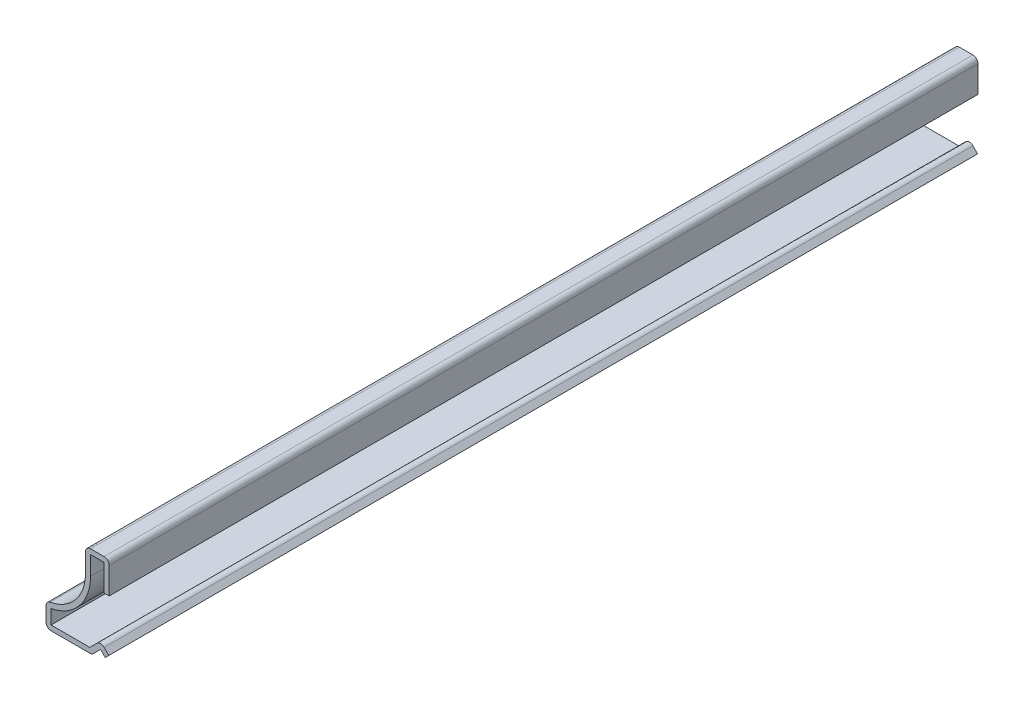
ISO-10303-21;
HEADER;
FILE_DESCRIPTION(('STEP AP214'),'2;1');
FILE_NAME('part.step','',(''),(''),'','','');
FILE_SCHEMA(('AUTOMOTIVE_DESIGN { 1 0 10303 214 1 1 1 1 }'));
ENDSEC;
DATA;
#1=APPLICATION_CONTEXT('core data for automotive mechanical design processes');
#2=APPLICATION_PROTOCOL_DEFINITION('international standard','automotive_design',2000,#1);
#3=PRODUCT_CONTEXT('',#1,'mechanical');
#4=PRODUCT('Part','Part','',(#3));
#5=PRODUCT_RELATED_PRODUCT_CATEGORY('part','',(#4));
#6=PRODUCT_DEFINITION_FORMATION('','',#4);
#7=PRODUCT_DEFINITION_CONTEXT('part definition',#1,'design');
#8=PRODUCT_DEFINITION('design','',#6,#7);
#9=PRODUCT_DEFINITION_SHAPE('','',#8);
#10=(LENGTH_UNIT() NAMED_UNIT(*) SI_UNIT(.MILLI.,.METRE.));
#11=(NAMED_UNIT(*) PLANE_ANGLE_UNIT() SI_UNIT($,.RADIAN.));
#12=(NAMED_UNIT(*) SI_UNIT($,.STERADIAN.) SOLID_ANGLE_UNIT());
#13=UNCERTAINTY_MEASURE_WITH_UNIT(LENGTH_MEASURE(1.E-05),#10,'distance_accuracy_value','');
#14=(GEOMETRIC_REPRESENTATION_CONTEXT(3) GLOBAL_UNCERTAINTY_ASSIGNED_CONTEXT((#13)) GLOBAL_UNIT_ASSIGNED_CONTEXT((#10,
#11,#12)) REPRESENTATION_CONTEXT('',''));
#15=CARTESIAN_POINT('',(0.,0.,0.));
#16=DIRECTION('',(0.,0.,1.));
#17=DIRECTION('',(1.,0.,0.));
#18=AXIS2_PLACEMENT_3D('',#15,#16,#17);
#19=CARTESIAN_POINT('',(0.,11.90625,-174.625));
#20=DIRECTION('',(0.,-1.,0.));
#21=DIRECTION('',(0.,0.,-1.));
#22=AXIS2_PLACEMENT_3D('',#19,#20,#21);
#23=PLANE('',#22);
#24=DIRECTION('',(1.,0.,0.));
#25=VECTOR('',#24,1.);
#26=CARTESIAN_POINT('',(0.,11.90625,0.));
#27=LINE('',#26,#25);
#28=CARTESIAN_POINT('',(-1.016,11.90625,0.));
#29=VERTEX_POINT('',#28);
#30=CARTESIAN_POINT('',(0.,11.90625,0.));
#31=VERTEX_POINT('',#30);
#32=EDGE_CURVE('E266',#29,#31,#27,.T.);
#33=ORIENTED_EDGE('',*,*,#32,.F.);
#34=DIRECTION('',(0.,0.,1.));
#35=VECTOR('',#34,1.);
#36=CARTESIAN_POINT('',(-1.016,11.90625,-174.625));
#37=LINE('',#36,#35);
#38=CARTESIAN_POINT('',(-1.016,11.90625,-174.625));
#39=VERTEX_POINT('',#38);
#40=EDGE_CURVE('E218',#39,#29,#37,.T.);
#41=ORIENTED_EDGE('',*,*,#40,.F.);
#42=DIRECTION('',(1.,0.,0.));
#43=VECTOR('',#42,1.);
#44=CARTESIAN_POINT('',(0.,11.90625,-174.625));
#45=LINE('',#44,#43);
#46=CARTESIAN_POINT('',(0.,11.90625,-174.625));
#47=VERTEX_POINT('',#46);
#48=EDGE_CURVE('E214',#39,#47,#45,.T.);
#49=ORIENTED_EDGE('',*,*,#48,.T.);
#50=DIRECTION('',(0.,0.,1.));
#51=VECTOR('',#50,1.);
#52=CARTESIAN_POINT('',(0.,11.90625,-174.625));
#53=LINE('',#52,#51);
#54=EDGE_CURVE('E197',#47,#31,#53,.T.);
#55=ORIENTED_EDGE('',*,*,#54,.T.);
#56=EDGE_LOOP('',(#33,#41,#49,#55));
#57=FACE_BOUND('',#56,.T.);
#58=ADVANCED_FACE('F35',(#57),#23,.T.);
#59=CARTESIAN_POINT('',(-1.016,11.90625,-174.625));
#60=DIRECTION('',(-1.,0.,0.));
#61=DIRECTION('',(0.,0.,1.));
#62=AXIS2_PLACEMENT_3D('',#59,#60,#61);
#63=PLANE('',#62);
#64=DIRECTION('',(0.,-1.,0.));
#65=VECTOR('',#64,1.);
#66=CARTESIAN_POINT('',(-1.016,11.90625,0.));
#67=LINE('',#66,#65);
#68=CARTESIAN_POINT('',(-1.016,17.24025,0.));
#69=VERTEX_POINT('',#68);
#70=EDGE_CURVE('E219',#69,#29,#67,.T.);
#71=ORIENTED_EDGE('',*,*,#70,.F.);
#72=DIRECTION('',(0.,0.,1.));
#73=VECTOR('',#72,1.);
#74=CARTESIAN_POINT('',(-1.016,17.24025,-174.625));
#75=LINE('',#74,#73);
#76=CARTESIAN_POINT('',(-1.016,17.24025,-174.625));
#77=VERTEX_POINT('',#76);
#78=EDGE_CURVE('E312',#77,#69,#75,.T.);
#79=ORIENTED_EDGE('',*,*,#78,.F.);
#80=DIRECTION('',(0.,-1.,0.));
#81=VECTOR('',#80,1.);
#82=CARTESIAN_POINT('',(-1.016,11.90625,-174.625));
#83=LINE('',#82,#81);
#84=EDGE_CURVE('E208',#77,#39,#83,.T.);
#85=ORIENTED_EDGE('',*,*,#84,.T.);
#86=ORIENTED_EDGE('',*,*,#40,.T.);
#87=EDGE_LOOP('',(#71,#79,#85,#86));
#88=FACE_BOUND('',#87,.T.);
#89=ADVANCED_FACE('F401',(#88),#63,.T.);
#90=CARTESIAN_POINT('',(-1.016,17.24025,-174.625));
#91=DIRECTION('',(0.,-1.,0.));
#92=DIRECTION('',(0.,0.,-1.));
#93=AXIS2_PLACEMENT_3D('',#90,#91,#92);
#94=PLANE('',#93);
#95=DIRECTION('',(1.,0.,0.));
#96=VECTOR('',#95,1.);
#97=CARTESIAN_POINT('',(-1.016,17.24025,0.));
#98=LINE('',#97,#96);
#99=CARTESIAN_POINT('',(-3.7465,17.24025,0.));
#100=VERTEX_POINT('',#99);
#101=EDGE_CURVE('E222',#100,#69,#98,.T.);
#102=ORIENTED_EDGE('',*,*,#101,.F.);
#103=DIRECTION('',(0.,0.,1.));
#104=VECTOR('',#103,1.);
#105=CARTESIAN_POINT('',(-3.7465,17.24025,-174.625));
#106=LINE('',#105,#104);
#107=CARTESIAN_POINT('',(-3.7465,17.24025,-174.625));
#108=VERTEX_POINT('',#107);
#109=EDGE_CURVE('E314',#108,#100,#106,.T.);
#110=ORIENTED_EDGE('',*,*,#109,.F.);
#111=DIRECTION('',(1.,0.,0.));
#112=VECTOR('',#111,1.);
#113=CARTESIAN_POINT('',(-1.016,17.24025,-174.625));
#114=LINE('',#113,#112);
#115=EDGE_CURVE('E262',#108,#77,#114,.T.);
#116=ORIENTED_EDGE('',*,*,#115,.T.);
#117=ORIENTED_EDGE('',*,*,#78,.T.);
#118=EDGE_LOOP('',(#102,#110,#116,#117));
#119=FACE_BOUND('',#118,.T.);
#120=ADVANCED_FACE('F406',(#119),#94,.T.);
#121=CARTESIAN_POINT('',(-3.7465,17.24025,-174.625));
#122=DIRECTION('',(1.,0.,0.));
#123=DIRECTION('',(0.,0.,-1.));
#124=AXIS2_PLACEMENT_3D('',#121,#122,#123);
#125=PLANE('',#124);
#126=DIRECTION('',(0.,1.,0.));
#127=VECTOR('',#126,1.);
#128=CARTESIAN_POINT('',(-3.7465,17.24025,0.));
#129=LINE('',#128,#127);
#130=CARTESIAN_POINT('',(-3.7465,13.4575956003945,0.));
#131=VERTEX_POINT('',#130);
#132=EDGE_CURVE('E305',#131,#100,#129,.T.);
#133=ORIENTED_EDGE('',*,*,#132,.F.);
#134=DIRECTION('',(0.,0.,1.));
#135=VECTOR('',#134,1.);
#136=CARTESIAN_POINT('',(-3.7465,13.4575956003945,-174.625));
#137=LINE('',#136,#135);
#138=CARTESIAN_POINT('',(-3.7465,13.4575956003945,-174.625));
#139=VERTEX_POINT('',#138);
#140=EDGE_CURVE('E316',#139,#131,#137,.T.);
#141=ORIENTED_EDGE('',*,*,#140,.F.);
#142=DIRECTION('',(0.,1.,0.));
#143=VECTOR('',#142,1.);
#144=CARTESIAN_POINT('',(-3.7465,17.24025,-174.625));
#145=LINE('',#144,#143);
#146=EDGE_CURVE('E259',#139,#108,#145,.T.);
#147=ORIENTED_EDGE('',*,*,#146,.T.);
#148=ORIENTED_EDGE('',*,*,#109,.T.);
#149=EDGE_LOOP('',(#133,#141,#147,#148));
#150=FACE_BOUND('',#149,.T.);
#151=ADVANCED_FACE('F487',(#150),#125,.T.);
#152=CARTESIAN_POINT('',(-13.49375,13.4575956003945,-174.625));
#153=DIRECTION('',(0.,0.,1.));
#154=DIRECTION('',(1.,0.,0.));
#155=AXIS2_PLACEMENT_3D('',#152,#153,#154);
#156=CYLINDRICAL_SURFACE('',#155,9.74725);
#157=CARTESIAN_POINT('',(-13.49375,13.4575956003945,0.));
#158=DIRECTION('',(0.,0.,1.));
#159=DIRECTION('',(-1.,0.,0.));
#160=AXIS2_PLACEMENT_3D('',#157,#158,#159);
#161=CIRCLE('',#160,9.74725);
#162=CARTESIAN_POINT('',(-11.684,3.87982511348056,0.));
#163=VERTEX_POINT('',#162);
#164=EDGE_CURVE('E302',#163,#131,#161,.T.);
#165=ORIENTED_EDGE('',*,*,#164,.F.);
#166=DIRECTION('',(0.,0.,1.));
#167=VECTOR('',#166,1.);
#168=CARTESIAN_POINT('',(-11.684,3.87982511348056,-174.625));
#169=LINE('',#168,#167);
#170=CARTESIAN_POINT('',(-11.684,3.87982511348056,-174.625));
#171=VERTEX_POINT('',#170);
#172=EDGE_CURVE('E318',#171,#163,#169,.T.);
#173=ORIENTED_EDGE('',*,*,#172,.F.);
#174=CARTESIAN_POINT('',(-13.49375,13.4575956003945,-174.625));
#175=DIRECTION('',(0.,0.,1.));
#176=DIRECTION('',(-1.,0.,0.));
#177=AXIS2_PLACEMENT_3D('',#174,#175,#176);
#178=CIRCLE('',#177,9.74725);
#179=EDGE_CURVE('E256',#171,#139,#178,.T.);
#180=ORIENTED_EDGE('',*,*,#179,.T.);
#181=ORIENTED_EDGE('',*,*,#140,.T.);
#182=EDGE_LOOP('',(#165,#173,#180,#181));
#183=FACE_BOUND('',#182,.T.);
#184=ADVANCED_FACE('F483',(#183),#156,.T.);
#185=CARTESIAN_POINT('',(-11.684,3.87982511348056,-174.625));
#186=DIRECTION('',(1.,0.,0.));
#187=DIRECTION('',(0.,0.,-1.));
#188=AXIS2_PLACEMENT_3D('',#185,#186,#187);
#189=PLANE('',#188);
#190=DIRECTION('',(0.,1.,0.));
#191=VECTOR('',#190,1.);
#192=CARTESIAN_POINT('',(-11.684,3.87982511348056,0.));
#193=LINE('',#192,#191);
#194=CARTESIAN_POINT('',(-11.684,1.016,0.));
#195=VERTEX_POINT('',#194);
#196=EDGE_CURVE('E299',#195,#163,#193,.T.);
#197=ORIENTED_EDGE('',*,*,#196,.F.);
#198=DIRECTION('',(0.,0.,1.));
#199=VECTOR('',#198,1.);
#200=CARTESIAN_POINT('',(-11.684,1.016,-174.625));
#201=LINE('',#200,#199);
#202=CARTESIAN_POINT('',(-11.684,1.016,-174.625));
#203=VERTEX_POINT('',#202);
#204=EDGE_CURVE('E320',#203,#195,#201,.T.);
#205=ORIENTED_EDGE('',*,*,#204,.F.);
#206=DIRECTION('',(0.,1.,0.));
#207=VECTOR('',#206,1.);
#208=CARTESIAN_POINT('',(-11.684,3.87982511348056,-174.625));
#209=LINE('',#208,#207);
#210=EDGE_CURVE('E253',#203,#171,#209,.T.);
#211=ORIENTED_EDGE('',*,*,#210,.T.);
#212=ORIENTED_EDGE('',*,*,#172,.T.);
#213=EDGE_LOOP('',(#197,#205,#211,#212));
#214=FACE_BOUND('',#213,.T.);
#215=ADVANCED_FACE('F479',(#214),#189,.T.);
#216=CARTESIAN_POINT('',(-11.684,1.016,-174.625));
#217=DIRECTION('',(0.,1.,0.));
#218=DIRECTION('',(0.,0.,1.));
#219=AXIS2_PLACEMENT_3D('',#216,#217,#218);
#220=PLANE('',#219);
#221=DIRECTION('',(-1.,0.,0.));
#222=VECTOR('',#221,1.);
#223=CARTESIAN_POINT('',(-11.684,1.016,0.));
#224=LINE('',#223,#222);
#225=CARTESIAN_POINT('',(-3.89715902062893,1.016,0.));
#226=VERTEX_POINT('',#225);
#227=EDGE_CURVE('E296',#226,#195,#224,.T.);
#228=ORIENTED_EDGE('',*,*,#227,.F.);
#229=DIRECTION('',(0.,0.,1.));
#230=VECTOR('',#229,1.);
#231=CARTESIAN_POINT('',(-3.89715902062893,1.016,-174.625));
#232=LINE('',#231,#230);
#233=CARTESIAN_POINT('',(-3.89715902062893,1.016,-174.625));
#234=VERTEX_POINT('',#233);
#235=EDGE_CURVE('E322',#234,#226,#232,.T.);
#236=ORIENTED_EDGE('',*,*,#235,.F.);
#237=DIRECTION('',(-1.,0.,0.));
#238=VECTOR('',#237,1.);
#239=CARTESIAN_POINT('',(-11.684,1.016,-174.625));
#240=LINE('',#239,#238);
#241=EDGE_CURVE('E250',#234,#203,#240,.T.);
#242=ORIENTED_EDGE('',*,*,#241,.T.);
#243=ORIENTED_EDGE('',*,*,#204,.T.);
#244=EDGE_LOOP('',(#228,#236,#242,#243));
#245=FACE_BOUND('',#244,.T.);
#246=ADVANCED_FACE('F475',(#245),#220,.T.);
#247=CARTESIAN_POINT('',(-3.89715902062893,1.016,-174.625));
#248=DIRECTION('',(-0.707106781186549,0.707106781186546,0.));
#249=DIRECTION('',(-0.707106781186546,-0.707106781186549,0.));
#250=AXIS2_PLACEMENT_3D('',#247,#248,#249);
#251=PLANE('',#250);
#252=DIRECTION('',(-0.707106781186546,-0.707106781186549,0.));
#253=VECTOR('',#252,1.);
#254=CARTESIAN_POINT('',(-3.89715902062893,1.016,0.));
#255=LINE('',#254,#253);
#256=CARTESIAN_POINT('',(-2.45657951031447,2.45657951031447,0.));
#257=VERTEX_POINT('',#256);
#258=EDGE_CURVE('E294',#257,#226,#255,.T.);
#259=ORIENTED_EDGE('',*,*,#258,.F.);
#260=DIRECTION('',(0.,0.,1.));
#261=VECTOR('',#260,1.);
#262=CARTESIAN_POINT('',(-2.45657951031447,2.45657951031447,-174.625));
#263=LINE('',#262,#261);
#264=CARTESIAN_POINT('',(-2.45657951031447,2.45657951031447,-174.625));
#265=VERTEX_POINT('',#264);
#266=EDGE_CURVE('E348',#257,#265,#263,.F.);
#267=ORIENTED_EDGE('',*,*,#266,.T.);
#268=DIRECTION('',(-0.707106781186546,-0.707106781186549,0.));
#269=VECTOR('',#268,1.);
#270=CARTESIAN_POINT('',(-3.89715902062893,1.016,-174.625));
#271=LINE('',#270,#269);
#272=EDGE_CURVE('E248',#265,#234,#271,.T.);
#273=ORIENTED_EDGE('',*,*,#272,.T.);
#274=ORIENTED_EDGE('',*,*,#235,.T.);
#275=EDGE_LOOP('',(#259,#267,#273,#274));
#276=FACE_BOUND('',#275,.T.);
#277=ADVANCED_FACE('F470',(#276),#251,.T.);
#278=CARTESIAN_POINT('',(-1.73815902062894,3.175,-174.625));
#279=DIRECTION('',(0.707106781186546,0.707106781186549,0.));
#280=DIRECTION('',(-0.707106781186549,0.707106781186546,0.));
#281=AXIS2_PLACEMENT_3D('',#278,#279,#280);
#282=PLANE('',#281);
#283=DIRECTION('',(-0.707106781186549,0.707106781186546,0.));
#284=VECTOR('',#283,1.);
#285=CARTESIAN_POINT('',(-1.73815902062894,3.175,-174.625));
#286=LINE('',#285,#284);
#287=CARTESIAN_POINT('',(-0.0753295103144666,1.51217048968553,-174.625));
#288=VERTEX_POINT('',#287);
#289=CARTESIAN_POINT('',(-1.01973853094341,2.45657951031447,-174.625));
#290=VERTEX_POINT('',#289);
#291=EDGE_CURVE('E245',#288,#290,#286,.T.);
#292=ORIENTED_EDGE('',*,*,#291,.T.);
#293=DIRECTION('',(0.,0.,1.));
#294=VECTOR('',#293,1.);
#295=CARTESIAN_POINT('',(-1.01973853094341,2.45657951031447,-174.625));
#296=LINE('',#295,#294);
#297=CARTESIAN_POINT('',(-1.01973853094341,2.45657951031447,0.));
#298=VERTEX_POINT('',#297);
#299=EDGE_CURVE('E311',#290,#298,#296,.T.);
#300=ORIENTED_EDGE('',*,*,#299,.T.);
#301=DIRECTION('',(-0.707106781186549,0.707106781186546,0.));
#302=VECTOR('',#301,1.);
#303=CARTESIAN_POINT('',(-1.73815902062894,3.175,0.));
#304=LINE('',#303,#302);
#305=CARTESIAN_POINT('',(-0.0753295103144666,1.51217048968553,0.));
#306=VERTEX_POINT('',#305);
#307=EDGE_CURVE('E291',#306,#298,#304,.T.);
#308=ORIENTED_EDGE('',*,*,#307,.F.);
#309=DIRECTION('',(0.,0.,1.));
#310=VECTOR('',#309,1.);
#311=CARTESIAN_POINT('',(-0.0753295103144666,1.51217048968553,-174.625));
#312=LINE('',#311,#310);
#313=EDGE_CURVE('E325',#288,#306,#312,.T.);
#314=ORIENTED_EDGE('',*,*,#313,.F.);
#315=EDGE_LOOP('',(#292,#300,#308,#314));
#316=FACE_BOUND('',#315,.T.);
#317=ADVANCED_FACE('F464',(#316),#282,.T.);
#318=CARTESIAN_POINT('',(-0.793749999999998,0.79375,-174.625));
#319=DIRECTION('',(0.707106781186549,-0.707106781186546,0.));
#320=DIRECTION('',(0.707106781186546,0.707106781186549,0.));
#321=AXIS2_PLACEMENT_3D('',#318,#319,#320);
#322=PLANE('',#321);
#323=DIRECTION('',(0.707106781186546,0.707106781186549,0.));
#324=VECTOR('',#323,1.);
#325=CARTESIAN_POINT('',(-0.793749999999998,0.79375,0.));
#326=LINE('',#325,#324);
#327=CARTESIAN_POINT('',(-0.793749999999998,0.79375,0.));
#328=VERTEX_POINT('',#327);
#329=EDGE_CURVE('E288',#328,#306,#326,.T.);
#330=ORIENTED_EDGE('',*,*,#329,.F.);
#331=DIRECTION('',(0.,0.,1.));
#332=VECTOR('',#331,1.);
#333=CARTESIAN_POINT('',(-0.793749999999998,0.79375,-174.625));
#334=LINE('',#333,#332);
#335=CARTESIAN_POINT('',(-0.793749999999998,0.79375,-174.625));
#336=VERTEX_POINT('',#335);
#337=EDGE_CURVE('E327',#336,#328,#334,.T.);
#338=ORIENTED_EDGE('',*,*,#337,.F.);
#339=DIRECTION('',(0.707106781186546,0.707106781186549,0.));
#340=VECTOR('',#339,1.);
#341=CARTESIAN_POINT('',(-0.793749999999998,0.79375,-174.625));
#342=LINE('',#341,#340);
#343=EDGE_CURVE('E242',#336,#288,#342,.T.);
#344=ORIENTED_EDGE('',*,*,#343,.T.);
#345=ORIENTED_EDGE('',*,*,#313,.T.);
#346=EDGE_LOOP('',(#330,#338,#344,#345));
#347=FACE_BOUND('',#346,.T.);
#348=ADVANCED_FACE('F460',(#347),#322,.T.);
#349=CARTESIAN_POINT('',(-1.73815902062894,1.73815902062894,-174.625));
#350=DIRECTION('',(-0.707106781186546,-0.707106781186549,0.));
#351=DIRECTION('',(0.707106781186549,-0.707106781186546,0.));
#352=AXIS2_PLACEMENT_3D('',#349,#350,#351);
#353=PLANE('',#352);
#354=DIRECTION('',(0.707106781186549,-0.707106781186546,0.));
#355=VECTOR('',#354,1.);
#356=CARTESIAN_POINT('',(-1.73815902062894,1.73815902062894,0.));
#357=LINE('',#356,#355);
#358=CARTESIAN_POINT('',(-1.73815902062894,1.73815902062894,0.));
#359=VERTEX_POINT('',#358);
#360=EDGE_CURVE('E285',#359,#328,#357,.T.);
#361=ORIENTED_EDGE('',*,*,#360,.F.);
#362=DIRECTION('',(0.,0.,1.));
#363=VECTOR('',#362,1.);
#364=CARTESIAN_POINT('',(-1.73815902062894,1.73815902062894,-174.625));
#365=LINE('',#364,#363);
#366=CARTESIAN_POINT('',(-1.73815902062894,1.73815902062894,-174.625));
#367=VERTEX_POINT('',#366);
#368=EDGE_CURVE('E329',#367,#359,#365,.T.);
#369=ORIENTED_EDGE('',*,*,#368,.F.);
#370=DIRECTION('',(0.707106781186549,-0.707106781186546,0.));
#371=VECTOR('',#370,1.);
#372=CARTESIAN_POINT('',(-1.73815902062894,1.73815902062894,-174.625));
#373=LINE('',#372,#371);
#374=EDGE_CURVE('E239',#367,#336,#373,.T.);
#375=ORIENTED_EDGE('',*,*,#374,.T.);
#376=ORIENTED_EDGE('',*,*,#337,.T.);
#377=EDGE_LOOP('',(#361,#369,#375,#376));
#378=FACE_BOUND('',#377,.T.);
#379=ADVANCED_FACE('F456',(#378),#353,.T.);
#380=CARTESIAN_POINT('',(-3.47631804125787,0.,-174.625));
#381=DIRECTION('',(0.707106781186549,-0.707106781186546,0.));
#382=DIRECTION('',(0.707106781186546,0.707106781186549,0.));
#383=AXIS2_PLACEMENT_3D('',#380,#381,#382);
#384=PLANE('',#383);
#385=DIRECTION('',(0.707106781186546,0.707106781186549,0.));
#386=VECTOR('',#385,1.);
#387=CARTESIAN_POINT('',(-3.47631804125787,0.,0.));
#388=LINE('',#387,#386);
#389=CARTESIAN_POINT('',(-3.1787385309434,0.297579510314469,0.));
#390=VERTEX_POINT('',#389);
#391=EDGE_CURVE('E283',#390,#359,#388,.T.);
#392=ORIENTED_EDGE('',*,*,#391,.F.);
#393=DIRECTION('',(0.,0.,1.));
#394=VECTOR('',#393,1.);
#395=CARTESIAN_POINT('',(-3.1787385309434,0.297579510314469,-174.625));
#396=LINE('',#395,#394);
#397=CARTESIAN_POINT('',(-3.1787385309434,0.297579510314469,-174.625));
#398=VERTEX_POINT('',#397);
#399=EDGE_CURVE('E365',#390,#398,#396,.F.);
#400=ORIENTED_EDGE('',*,*,#399,.T.);
#401=DIRECTION('',(0.707106781186546,0.707106781186549,0.));
#402=VECTOR('',#401,1.);
#403=CARTESIAN_POINT('',(-3.47631804125787,0.,-174.625));
#404=LINE('',#403,#402);
#405=EDGE_CURVE('E237',#398,#367,#404,.T.);
#406=ORIENTED_EDGE('',*,*,#405,.T.);
#407=ORIENTED_EDGE('',*,*,#368,.T.);
#408=EDGE_LOOP('',(#392,#400,#406,#407));
#409=FACE_BOUND('',#408,.T.);
#410=ADVANCED_FACE('F450',(#409),#384,.T.);
#411=CARTESIAN_POINT('',(-12.7,0.,-174.625));
#412=DIRECTION('',(0.,-1.,0.));
#413=DIRECTION('',(1.,0.,0.));
#414=AXIS2_PLACEMENT_3D('',#411,#412,#413);
#415=PLANE('',#414);
#416=DIRECTION('',(1.,0.,0.));
#417=VECTOR('',#416,1.);
#418=CARTESIAN_POINT('',(-12.7,0.,-174.625));
#419=LINE('',#418,#417);
#420=CARTESIAN_POINT('',(-11.684,0.,-174.625));
#421=VERTEX_POINT('',#420);
#422=CARTESIAN_POINT('',(-3.89715902062893,0.,-174.625));
#423=VERTEX_POINT('',#422);
#424=EDGE_CURVE('E234',#421,#423,#419,.T.);
#425=ORIENTED_EDGE('',*,*,#424,.T.);
#426=DIRECTION('',(0.,0.,1.));
#427=VECTOR('',#426,1.);
#428=CARTESIAN_POINT('',(-3.89715902062893,0.,-174.625));
#429=LINE('',#428,#427);
#430=CARTESIAN_POINT('',(-3.89715902062893,0.,0.));
#431=VERTEX_POINT('',#430);
#432=EDGE_CURVE('E362',#423,#431,#429,.T.);
#433=ORIENTED_EDGE('',*,*,#432,.T.);
#434=DIRECTION('',(1.,0.,0.));
#435=VECTOR('',#434,1.);
#436=CARTESIAN_POINT('',(-12.7,0.,0.));
#437=LINE('',#436,#435);
#438=CARTESIAN_POINT('',(-11.684,0.,0.));
#439=VERTEX_POINT('',#438);
#440=EDGE_CURVE('E280',#439,#431,#437,.T.);
#441=ORIENTED_EDGE('',*,*,#440,.F.);
#442=DIRECTION('',(0.,0.,1.));
#443=VECTOR('',#442,1.);
#444=CARTESIAN_POINT('',(-11.684,0.,-174.625));
#445=LINE('',#444,#443);
#446=EDGE_CURVE('E360',#439,#421,#445,.F.);
#447=ORIENTED_EDGE('',*,*,#446,.T.);
#448=EDGE_LOOP('',(#425,#433,#441,#447));
#449=FACE_BOUND('',#448,.T.);
#450=ADVANCED_FACE('F443',(#449),#415,.T.);
#451=CARTESIAN_POINT('',(-12.7,4.7625,-174.625));
#452=DIRECTION('',(-1.,0.,0.));
#453=DIRECTION('',(0.,0.,1.));
#454=AXIS2_PLACEMENT_3D('',#451,#452,#453);
#455=PLANE('',#454);
#456=DIRECTION('',(0.,-1.,0.));
#457=VECTOR('',#456,1.);
#458=CARTESIAN_POINT('',(-12.7,4.7625,-174.625));
#459=LINE('',#458,#457);
#460=CARTESIAN_POINT('',(-12.7,3.87982511348056,-174.625));
#461=VERTEX_POINT('',#460);
#462=CARTESIAN_POINT('',(-12.7,1.016,-174.625));
#463=VERTEX_POINT('',#462);
#464=EDGE_CURVE('E231',#461,#463,#459,.T.);
#465=ORIENTED_EDGE('',*,*,#464,.T.);
#466=DIRECTION('',(0.,0.,1.));
#467=VECTOR('',#466,1.);
#468=CARTESIAN_POINT('',(-12.7,1.016,-174.625));
#469=LINE('',#468,#467);
#470=CARTESIAN_POINT('',(-12.7,1.016,0.));
#471=VERTEX_POINT('',#470);
#472=EDGE_CURVE('E369',#463,#471,#469,.T.);
#473=ORIENTED_EDGE('',*,*,#472,.T.);
#474=DIRECTION('',(0.,-1.,0.));
#475=VECTOR('',#474,1.);
#476=CARTESIAN_POINT('',(-12.7,4.7625,0.));
#477=LINE('',#476,#475);
#478=CARTESIAN_POINT('',(-12.7,3.87982511348056,0.));
#479=VERTEX_POINT('',#478);
#480=EDGE_CURVE('E277',#479,#471,#477,.T.);
#481=ORIENTED_EDGE('',*,*,#480,.F.);
#482=DIRECTION('',(0.,0.,1.));
#483=VECTOR('',#482,1.);
#484=CARTESIAN_POINT('',(-12.7,3.87982511348056,-174.625));
#485=LINE('',#484,#483);
#486=EDGE_CURVE('E367',#479,#461,#485,.F.);
#487=ORIENTED_EDGE('',*,*,#486,.T.);
#488=EDGE_LOOP('',(#465,#473,#481,#487));
#489=FACE_BOUND('',#488,.T.);
#490=ADVANCED_FACE('F437',(#489),#455,.T.);
#491=CARTESIAN_POINT('',(-13.49375,13.4575956003945,-174.625));
#492=DIRECTION('',(0.,0.,1.));
#493=DIRECTION('',(1.,0.,0.));
#494=AXIS2_PLACEMENT_3D('',#491,#492,#493);
#495=CYLINDRICAL_SURFACE('',#494,8.73125);
#496=CARTESIAN_POINT('',(-13.49375,13.4575956003945,-174.625));
#497=DIRECTION('',(0.,0.,-1.));
#498=DIRECTION('',(-1.,0.,0.));
#499=AXIS2_PLACEMENT_3D('',#496,#497,#498);
#500=CIRCLE('',#499,8.73125);
#501=CARTESIAN_POINT('',(-4.7625,13.4575956003945,-174.625));
#502=VERTEX_POINT('',#501);
#503=CARTESIAN_POINT('',(-11.8726384364821,4.87815949648136,-174.625));
#504=VERTEX_POINT('',#503);
#505=EDGE_CURVE('E228',#502,#504,#500,.T.);
#506=ORIENTED_EDGE('',*,*,#505,.T.);
#507=DIRECTION('',(0.,0.,1.));
#508=VECTOR('',#507,1.);
#509=CARTESIAN_POINT('',(-11.8726384364821,4.87815949648136,-174.625));
#510=LINE('',#509,#508);
#511=CARTESIAN_POINT('',(-11.8726384364821,4.87815949648136,0.));
#512=VERTEX_POINT('',#511);
#513=EDGE_CURVE('E372',#504,#512,#510,.T.);
#514=ORIENTED_EDGE('',*,*,#513,.T.);
#515=CARTESIAN_POINT('',(-13.49375,13.4575956003945,0.));
#516=DIRECTION('',(0.,0.,-1.));
#517=DIRECTION('',(-1.,0.,0.));
#518=AXIS2_PLACEMENT_3D('',#515,#516,#517);
#519=CIRCLE('',#518,8.73125);
#520=CARTESIAN_POINT('',(-4.7625,13.4575956003945,0.));
#521=VERTEX_POINT('',#520);
#522=EDGE_CURVE('E274',#521,#512,#519,.T.);
#523=ORIENTED_EDGE('',*,*,#522,.F.);
#524=DIRECTION('',(0.,0.,1.));
#525=VECTOR('',#524,1.);
#526=CARTESIAN_POINT('',(-4.7625,13.4575956003945,-174.625));
#527=LINE('',#526,#525);
#528=EDGE_CURVE('E207',#502,#521,#527,.T.);
#529=ORIENTED_EDGE('',*,*,#528,.F.);
#530=EDGE_LOOP('',(#506,#514,#523,#529));
#531=FACE_BOUND('',#530,.T.);
#532=ADVANCED_FACE('F433',(#531),#495,.F.);
#533=CARTESIAN_POINT('',(-4.7625,18.25625,-174.625));
#534=DIRECTION('',(-1.,0.,0.));
#535=DIRECTION('',(0.,-1.,0.));
#536=AXIS2_PLACEMENT_3D('',#533,#534,#535);
#537=PLANE('',#536);
#538=DIRECTION('',(0.,-1.,0.));
#539=VECTOR('',#538,1.);
#540=CARTESIAN_POINT('',(-4.7625,18.25625,0.));
#541=LINE('',#540,#539);
#542=CARTESIAN_POINT('',(-4.7625,17.24025,0.));
#543=VERTEX_POINT('',#542);
#544=EDGE_CURVE('E272',#543,#521,#541,.T.);
#545=ORIENTED_EDGE('',*,*,#544,.F.);
#546=DIRECTION('',(0.,0.,1.));
#547=VECTOR('',#546,1.);
#548=CARTESIAN_POINT('',(-4.7625,17.24025,-174.625));
#549=LINE('',#548,#547);
#550=CARTESIAN_POINT('',(-4.7625,17.24025,-174.625));
#551=VERTEX_POINT('',#550);
#552=EDGE_CURVE('E43',#543,#551,#549,.F.);
#553=ORIENTED_EDGE('',*,*,#552,.T.);
#554=DIRECTION('',(0.,-1.,0.));
#555=VECTOR('',#554,1.);
#556=CARTESIAN_POINT('',(-4.7625,18.25625,-174.625));
#557=LINE('',#556,#555);
#558=EDGE_CURVE('E226',#551,#502,#557,.T.);
#559=ORIENTED_EDGE('',*,*,#558,.T.);
#560=ORIENTED_EDGE('',*,*,#528,.T.);
#561=EDGE_LOOP('',(#545,#553,#559,#560));
#562=FACE_BOUND('',#561,.T.);
#563=ADVANCED_FACE('F382',(#562),#537,.T.);
#564=CARTESIAN_POINT('',(0.,18.25625,-174.625));
#565=DIRECTION('',(0.,1.,0.));
#566=DIRECTION('',(-1.,0.,0.));
#567=AXIS2_PLACEMENT_3D('',#564,#565,#566);
#568=PLANE('',#567);
#569=DIRECTION('',(-1.,0.,0.));
#570=VECTOR('',#569,1.);
#571=CARTESIAN_POINT('',(0.,18.25625,-174.625));
#572=LINE('',#571,#570);
#573=CARTESIAN_POINT('',(-1.016,18.25625,-174.625));
#574=VERTEX_POINT('',#573);
#575=CARTESIAN_POINT('',(-3.7465,18.25625,-174.625));
#576=VERTEX_POINT('',#575);
#577=EDGE_CURVE('E216',#574,#576,#572,.T.);
#578=ORIENTED_EDGE('',*,*,#577,.T.);
#579=DIRECTION('',(0.,0.,1.));
#580=VECTOR('',#579,1.);
#581=CARTESIAN_POINT('',(-3.7465,18.25625,-174.625));
#582=LINE('',#581,#580);
#583=CARTESIAN_POINT('',(-3.7465,18.25625,0.));
#584=VERTEX_POINT('',#583);
#585=EDGE_CURVE('E377',#576,#584,#582,.T.);
#586=ORIENTED_EDGE('',*,*,#585,.T.);
#587=DIRECTION('',(-1.,0.,0.));
#588=VECTOR('',#587,1.);
#589=CARTESIAN_POINT('',(0.,18.25625,0.));
#590=LINE('',#589,#588);
#591=CARTESIAN_POINT('',(-1.016,18.25625,0.));
#592=VERTEX_POINT('',#591);
#593=EDGE_CURVE('E269',#592,#584,#590,.T.);
#594=ORIENTED_EDGE('',*,*,#593,.F.);
#595=DIRECTION('',(0.,0.,1.));
#596=VECTOR('',#595,1.);
#597=CARTESIAN_POINT('',(-1.016,18.25625,-174.625));
#598=LINE('',#597,#596);
#599=EDGE_CURVE('E375',#592,#574,#598,.F.);
#600=ORIENTED_EDGE('',*,*,#599,.T.);
#601=EDGE_LOOP('',(#578,#586,#594,#600));
#602=FACE_BOUND('',#601,.T.);
#603=ADVANCED_FACE('F390',(#602),#568,.T.);
#604=CARTESIAN_POINT('',(0.,11.90625,-174.625));
#605=DIRECTION('',(1.,0.,0.));
#606=DIRECTION('',(0.,1.,0.));
#607=AXIS2_PLACEMENT_3D('',#604,#605,#606);
#608=PLANE('',#607);
#609=DIRECTION('',(0.,1.,0.));
#610=VECTOR('',#609,1.);
#611=CARTESIAN_POINT('',(0.,11.90625,-174.625));
#612=LINE('',#611,#610);
#613=CARTESIAN_POINT('',(0.,17.24025,-174.625));
#614=VERTEX_POINT('',#613);
#615=EDGE_CURVE('E199',#47,#614,#612,.T.);
#616=ORIENTED_EDGE('',*,*,#615,.T.);
#617=DIRECTION('',(0.,0.,1.));
#618=VECTOR('',#617,1.);
#619=CARTESIAN_POINT('',(0.,17.24025,-174.625));
#620=LINE('',#619,#618);
#621=CARTESIAN_POINT('',(0.,17.24025,0.));
#622=VERTEX_POINT('',#621);
#623=EDGE_CURVE('E11',#614,#622,#620,.T.);
#624=ORIENTED_EDGE('',*,*,#623,.T.);
#625=DIRECTION('',(0.,1.,0.));
#626=VECTOR('',#625,1.);
#627=CARTESIAN_POINT('',(0.,11.90625,0.));
#628=LINE('',#627,#626);
#629=EDGE_CURVE('E202',#31,#622,#628,.T.);
#630=ORIENTED_EDGE('',*,*,#629,.F.);
#631=ORIENTED_EDGE('',*,*,#54,.F.);
#632=EDGE_LOOP('',(#616,#624,#630,#631));
#633=FACE_BOUND('',#632,.T.);
#634=ADVANCED_FACE('F198',(#633),#608,.T.);
#635=CARTESIAN_POINT('',(-13.49375,13.4575956003945,-174.625));
#636=DIRECTION('',(0.,0.,-1.));
#637=DIRECTION('',(-1.,0.,0.));
#638=AXIS2_PLACEMENT_3D('',#635,#636,#637);
#639=PLANE('',#638);
#640=ORIENTED_EDGE('',*,*,#272,.F.);
#641=CARTESIAN_POINT('',(-1.73815902062894,1.73815902062894,-174.625));
#642=DIRECTION('',(0.,0.,-1.));
#643=DIRECTION('',(-1.,0.,0.));
#644=AXIS2_PLACEMENT_3D('',#641,#642,#643);
#645=CIRCLE('',#644,1.016);
#646=EDGE_CURVE('E358',#265,#290,#645,.T.);
#647=ORIENTED_EDGE('',*,*,#646,.T.);
#648=ORIENTED_EDGE('',*,*,#291,.F.);
#649=ORIENTED_EDGE('',*,*,#343,.F.);
#650=ORIENTED_EDGE('',*,*,#374,.F.);
#651=ORIENTED_EDGE('',*,*,#405,.F.);
#652=CARTESIAN_POINT('',(-3.89715902062893,1.016,-174.625));
#653=DIRECTION('',(0.,0.,-1.));
#654=DIRECTION('',(-1.,0.,0.));
#655=AXIS2_PLACEMENT_3D('',#652,#653,#654);
#656=CIRCLE('',#655,1.016);
#657=EDGE_CURVE('E356',#398,#423,#656,.T.);
#658=ORIENTED_EDGE('',*,*,#657,.T.);
#659=ORIENTED_EDGE('',*,*,#424,.F.);
#660=CARTESIAN_POINT('',(-11.684,1.016,-174.625));
#661=DIRECTION('',(0.,0.,-1.));
#662=DIRECTION('',(-1.,0.,0.));
#663=AXIS2_PLACEMENT_3D('',#660,#661,#662);
#664=CIRCLE('',#663,1.016);
#665=EDGE_CURVE('E354',#421,#463,#664,.T.);
#666=ORIENTED_EDGE('',*,*,#665,.T.);
#667=ORIENTED_EDGE('',*,*,#464,.F.);
#668=CARTESIAN_POINT('',(-11.684,3.87982511348056,-174.625));
#669=DIRECTION('',(0.,0.,-1.));
#670=DIRECTION('',(-1.,0.,0.));
#671=AXIS2_PLACEMENT_3D('',#668,#669,#670);
#672=CIRCLE('',#671,1.016);
#673=EDGE_CURVE('E352',#461,#504,#672,.T.);
#674=ORIENTED_EDGE('',*,*,#673,.T.);
#675=ORIENTED_EDGE('',*,*,#505,.F.);
#676=ORIENTED_EDGE('',*,*,#558,.F.);
#677=CARTESIAN_POINT('',(-3.7465,17.24025,-174.625));
#678=DIRECTION('',(0.,0.,-1.));
#679=DIRECTION('',(-1.,0.,0.));
#680=AXIS2_PLACEMENT_3D('',#677,#678,#679);
#681=CIRCLE('',#680,1.016);
#682=EDGE_CURVE('E56',#551,#576,#681,.T.);
#683=ORIENTED_EDGE('',*,*,#682,.T.);
#684=ORIENTED_EDGE('',*,*,#577,.F.);
#685=CARTESIAN_POINT('',(-1.01600000000001,17.24025,-174.625));
#686=DIRECTION('',(0.,0.,-1.));
#687=DIRECTION('',(-1.,0.,0.));
#688=AXIS2_PLACEMENT_3D('',#685,#686,#687);
#689=CIRCLE('',#688,1.016);
#690=EDGE_CURVE('E50',#574,#614,#689,.T.);
#691=ORIENTED_EDGE('',*,*,#690,.T.);
#692=ORIENTED_EDGE('',*,*,#615,.F.);
#693=ORIENTED_EDGE('',*,*,#48,.F.);
#694=ORIENTED_EDGE('',*,*,#84,.F.);
#695=ORIENTED_EDGE('',*,*,#115,.F.);
#696=ORIENTED_EDGE('',*,*,#146,.F.);
#697=ORIENTED_EDGE('',*,*,#179,.F.);
#698=ORIENTED_EDGE('',*,*,#210,.F.);
#699=ORIENTED_EDGE('',*,*,#241,.F.);
#700=EDGE_LOOP('',(#640,#647,#648,#649,#650,#651,#658,#659,#666,#667,#674,#675,#676,#683,#684,
#691,#692,#693,#694,#695,#696,#697,#698,#699));
#701=FACE_BOUND('',#700,.T.);
#702=ADVANCED_FACE('F212',(#701),#639,.T.);
#703=CARTESIAN_POINT('',(-13.49375,13.4575956003945,0.));
#704=DIRECTION('',(0.,0.,-1.));
#705=DIRECTION('',(-1.,0.,0.));
#706=AXIS2_PLACEMENT_3D('',#703,#704,#705);
#707=PLANE('',#706);
#708=ORIENTED_EDGE('',*,*,#307,.T.);
#709=CARTESIAN_POINT('',(-1.73815902062894,1.73815902062894,0.));
#710=DIRECTION('',(0.,0.,-1.));
#711=DIRECTION('',(-1.,0.,0.));
#712=AXIS2_PLACEMENT_3D('',#709,#710,#711);
#713=CIRCLE('',#712,1.016);
#714=EDGE_CURVE('E346',#298,#257,#713,.F.);
#715=ORIENTED_EDGE('',*,*,#714,.T.);
#716=ORIENTED_EDGE('',*,*,#258,.T.);
#717=ORIENTED_EDGE('',*,*,#227,.T.);
#718=ORIENTED_EDGE('',*,*,#196,.T.);
#719=ORIENTED_EDGE('',*,*,#164,.T.);
#720=ORIENTED_EDGE('',*,*,#132,.T.);
#721=ORIENTED_EDGE('',*,*,#101,.T.);
#722=ORIENTED_EDGE('',*,*,#70,.T.);
#723=ORIENTED_EDGE('',*,*,#32,.T.);
#724=ORIENTED_EDGE('',*,*,#629,.T.);
#725=CARTESIAN_POINT('',(-1.01600000000001,17.24025,0.));
#726=DIRECTION('',(0.,0.,-1.));
#727=DIRECTION('',(-1.,0.,0.));
#728=AXIS2_PLACEMENT_3D('',#725,#726,#727);
#729=CIRCLE('',#728,1.016);
#730=EDGE_CURVE('E336',#622,#592,#729,.F.);
#731=ORIENTED_EDGE('',*,*,#730,.T.);
#732=ORIENTED_EDGE('',*,*,#593,.T.);
#733=CARTESIAN_POINT('',(-3.7465,17.24025,0.));
#734=DIRECTION('',(0.,0.,-1.));
#735=DIRECTION('',(-1.,0.,0.));
#736=AXIS2_PLACEMENT_3D('',#733,#734,#735);
#737=CIRCLE('',#736,1.016);
#738=EDGE_CURVE('E338',#584,#543,#737,.F.);
#739=ORIENTED_EDGE('',*,*,#738,.T.);
#740=ORIENTED_EDGE('',*,*,#544,.T.);
#741=ORIENTED_EDGE('',*,*,#522,.T.);
#742=CARTESIAN_POINT('',(-11.684,3.87982511348056,0.));
#743=DIRECTION('',(0.,0.,-1.));
#744=DIRECTION('',(-1.,0.,0.));
#745=AXIS2_PLACEMENT_3D('',#742,#743,#744);
#746=CIRCLE('',#745,1.016);
#747=EDGE_CURVE('E340',#512,#479,#746,.F.);
#748=ORIENTED_EDGE('',*,*,#747,.T.);
#749=ORIENTED_EDGE('',*,*,#480,.T.);
#750=CARTESIAN_POINT('',(-11.684,1.016,0.));
#751=DIRECTION('',(0.,0.,-1.));
#752=DIRECTION('',(-1.,0.,0.));
#753=AXIS2_PLACEMENT_3D('',#750,#751,#752);
#754=CIRCLE('',#753,1.016);
#755=EDGE_CURVE('E342',#471,#439,#754,.F.);
#756=ORIENTED_EDGE('',*,*,#755,.T.);
#757=ORIENTED_EDGE('',*,*,#440,.T.);
#758=CARTESIAN_POINT('',(-3.89715902062893,1.016,0.));
#759=DIRECTION('',(0.,0.,-1.));
#760=DIRECTION('',(-1.,0.,0.));
#761=AXIS2_PLACEMENT_3D('',#758,#759,#760);
#762=CIRCLE('',#761,1.016);
#763=EDGE_CURVE('E344',#431,#390,#762,.F.);
#764=ORIENTED_EDGE('',*,*,#763,.T.);
#765=ORIENTED_EDGE('',*,*,#391,.T.);
#766=ORIENTED_EDGE('',*,*,#360,.T.);
#767=ORIENTED_EDGE('',*,*,#329,.T.);
#768=EDGE_LOOP('',(#708,#715,#716,#717,#718,#719,#720,#721,#722,#723,#724,#731,#732,#739,#740,
#741,#748,#749,#756,#757,#764,#765,#766,#767));
#769=FACE_BOUND('',#768,.T.);
#770=ADVANCED_FACE('F393',(#769),#707,.F.);
#771=CARTESIAN_POINT('',(-1.73815902062894,1.73815902062894,-174.625));
#772=DIRECTION('',(0.,0.,1.));
#773=DIRECTION('',(1.,0.,0.));
#774=AXIS2_PLACEMENT_3D('',#771,#772,#773);
#775=CYLINDRICAL_SURFACE('',#774,1.016);
#776=ORIENTED_EDGE('',*,*,#646,.F.);
#777=ORIENTED_EDGE('',*,*,#266,.F.);
#778=ORIENTED_EDGE('',*,*,#714,.F.);
#779=ORIENTED_EDGE('',*,*,#299,.F.);
#780=EDGE_LOOP('',(#776,#777,#778,#779));
#781=FACE_BOUND('',#780,.T.);
#782=ADVANCED_FACE('F412',(#781),#775,.T.);
#783=CARTESIAN_POINT('',(-3.89715902062893,1.016,-174.625));
#784=DIRECTION('',(0.,0.,1.));
#785=DIRECTION('',(1.,0.,0.));
#786=AXIS2_PLACEMENT_3D('',#783,#784,#785);
#787=CYLINDRICAL_SURFACE('',#786,1.016);
#788=ORIENTED_EDGE('',*,*,#657,.F.);
#789=ORIENTED_EDGE('',*,*,#399,.F.);
#790=ORIENTED_EDGE('',*,*,#763,.F.);
#791=ORIENTED_EDGE('',*,*,#432,.F.);
#792=EDGE_LOOP('',(#788,#789,#790,#791));
#793=FACE_BOUND('',#792,.T.);
#794=ADVANCED_FACE('F415',(#793),#787,.T.);
#795=CARTESIAN_POINT('',(-11.684,1.016,-174.625));
#796=DIRECTION('',(0.,0.,1.));
#797=DIRECTION('',(1.,0.,0.));
#798=AXIS2_PLACEMENT_3D('',#795,#796,#797);
#799=CYLINDRICAL_SURFACE('',#798,1.016);
#800=ORIENTED_EDGE('',*,*,#665,.F.);
#801=ORIENTED_EDGE('',*,*,#446,.F.);
#802=ORIENTED_EDGE('',*,*,#755,.F.);
#803=ORIENTED_EDGE('',*,*,#472,.F.);
#804=EDGE_LOOP('',(#800,#801,#802,#803));
#805=FACE_BOUND('',#804,.T.);
#806=ADVANCED_FACE('F419',(#805),#799,.T.);
#807=CARTESIAN_POINT('',(-11.684,3.87982511348056,-174.625));
#808=DIRECTION('',(0.,0.,1.));
#809=DIRECTION('',(1.,0.,0.));
#810=AXIS2_PLACEMENT_3D('',#807,#808,#809);
#811=CYLINDRICAL_SURFACE('',#810,1.016);
#812=ORIENTED_EDGE('',*,*,#673,.F.);
#813=ORIENTED_EDGE('',*,*,#486,.F.);
#814=ORIENTED_EDGE('',*,*,#747,.F.);
#815=ORIENTED_EDGE('',*,*,#513,.F.);
#816=EDGE_LOOP('',(#812,#813,#814,#815));
#817=FACE_BOUND('',#816,.T.);
#818=ADVANCED_FACE('F399',(#817),#811,.T.);
#819=CARTESIAN_POINT('',(-3.7465,17.24025,-174.625));
#820=DIRECTION('',(0.,0.,1.));
#821=DIRECTION('',(1.,0.,0.));
#822=AXIS2_PLACEMENT_3D('',#819,#820,#821);
#823=CYLINDRICAL_SURFACE('',#822,1.016);
#824=ORIENTED_EDGE('',*,*,#682,.F.);
#825=ORIENTED_EDGE('',*,*,#552,.F.);
#826=ORIENTED_EDGE('',*,*,#738,.F.);
#827=ORIENTED_EDGE('',*,*,#585,.F.);
#828=EDGE_LOOP('',(#824,#825,#826,#827));
#829=FACE_BOUND('',#828,.T.);
#830=ADVANCED_FACE('F387',(#829),#823,.T.);
#831=CARTESIAN_POINT('',(-1.01600000000001,17.24025,-174.625));
#832=DIRECTION('',(0.,0.,1.));
#833=DIRECTION('',(1.,0.,0.));
#834=AXIS2_PLACEMENT_3D('',#831,#832,#833);
#835=CYLINDRICAL_SURFACE('',#834,1.016);
#836=ORIENTED_EDGE('',*,*,#690,.F.);
#837=ORIENTED_EDGE('',*,*,#599,.F.);
#838=ORIENTED_EDGE('',*,*,#730,.F.);
#839=ORIENTED_EDGE('',*,*,#623,.F.);
#840=EDGE_LOOP('',(#836,#837,#838,#839));
#841=FACE_BOUND('',#840,.T.);
#842=ADVANCED_FACE('F37',(#841),#835,.T.);
#843=CLOSED_SHELL('',(#58,#89,#120,#151,#184,#215,#246,#277,#317,#348,#379,#410,#450,#490,#532,
#563,#603,#634,#702,#770,#782,#794,#806,#818,#830,#842));
#844=MANIFOLD_SOLID_BREP('B2',#843);
#845=ADVANCED_BREP_SHAPE_REPRESENTATION('',(#18,#844),#14);
#846=SHAPE_DEFINITION_REPRESENTATION(#9,#845);
ENDSEC;
END-ISO-10303-21;
